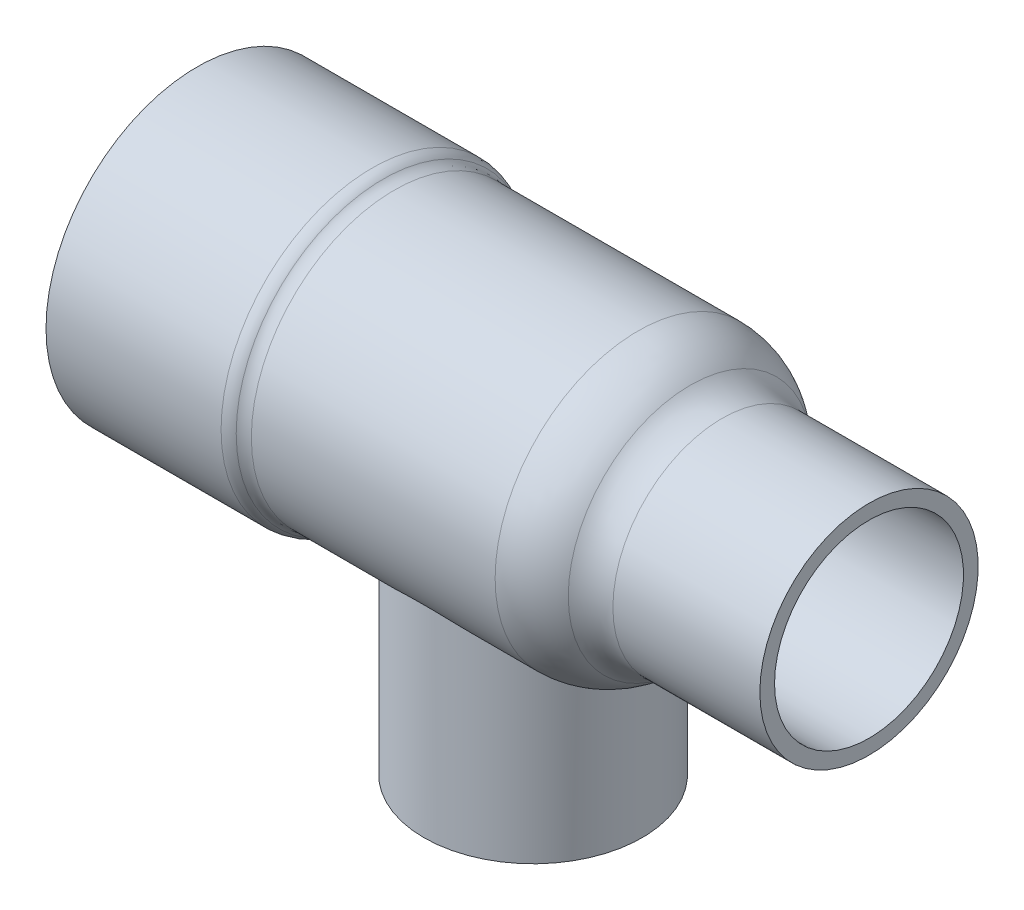
ISO-10303-21;
HEADER;
FILE_DESCRIPTION(('STEP AP214'),'2;1');
FILE_NAME('part.step','',(''),(''),'','','');
FILE_SCHEMA(('AUTOMOTIVE_DESIGN { 1 0 10303 214 1 1 1 1 }'));
ENDSEC;
DATA;
#1=APPLICATION_CONTEXT('core data for automotive mechanical design processes');
#2=APPLICATION_PROTOCOL_DEFINITION('international standard','automotive_design',2000,#1);
#3=PRODUCT_CONTEXT('',#1,'mechanical');
#4=PRODUCT('Part','Part','',(#3));
#5=PRODUCT_RELATED_PRODUCT_CATEGORY('part','',(#4));
#6=PRODUCT_DEFINITION_FORMATION('','',#4);
#7=PRODUCT_DEFINITION_CONTEXT('part definition',#1,'design');
#8=PRODUCT_DEFINITION('design','',#6,#7);
#9=PRODUCT_DEFINITION_SHAPE('','',#8);
#10=(LENGTH_UNIT() NAMED_UNIT(*) SI_UNIT(.MILLI.,.METRE.));
#11=(NAMED_UNIT(*) PLANE_ANGLE_UNIT() SI_UNIT($,.RADIAN.));
#12=(NAMED_UNIT(*) SI_UNIT($,.STERADIAN.) SOLID_ANGLE_UNIT());
#13=UNCERTAINTY_MEASURE_WITH_UNIT(LENGTH_MEASURE(1.E-05),#10,'distance_accuracy_value','');
#14=(GEOMETRIC_REPRESENTATION_CONTEXT(3) GLOBAL_UNCERTAINTY_ASSIGNED_CONTEXT((#13)) GLOBAL_UNIT_ASSIGNED_CONTEXT((#10,
#11,#12)) REPRESENTATION_CONTEXT('',''));
#15=CARTESIAN_POINT('',(0.,0.,0.));
#16=DIRECTION('',(0.,0.,1.));
#17=DIRECTION('',(1.,0.,0.));
#18=AXIS2_PLACEMENT_3D('',#15,#16,#17);
#19=CARTESIAN_POINT('',(66.675,0.,0.));
#20=DIRECTION('',(-1.,0.,0.));
#21=DIRECTION('',(0.,0.,1.));
#22=AXIS2_PLACEMENT_3D('',#19,#20,#21);
#23=DEGENERATE_TOROIDAL_SURFACE('',#22,10.2185400497512,11.3968599502488,.T.);
#24=CARTESIAN_POINT('',(74.5632953226745,0.,0.));
#25=DIRECTION('',(-1.,0.,0.));
#26=DIRECTION('',(0.,0.,1.));
#27=AXIS2_PLACEMENT_3D('',#24,#25,#26);
#28=CIRCLE('',#27,18.4443052802848);
#29=CARTESIAN_POINT('',(74.5632953226745,0.,18.4443052802848));
#30=VERTEX_POINT('',#29);
#31=EDGE_CURVE('E70',#30,#30,#28,.T.);
#32=ORIENTED_EDGE('',*,*,#31,.T.);
#33=EDGE_LOOP('',(#32));
#34=FACE_BOUND('',#33,.T.);
#35=CARTESIAN_POINT('',(66.675,0.,0.));
#36=DIRECTION('',(-1.,0.,0.));
#37=DIRECTION('',(0.,0.,1.));
#38=AXIS2_PLACEMENT_3D('',#35,#36,#37);
#39=CIRCLE('',#38,21.6154);
#40=CARTESIAN_POINT('',(66.675,-21.1343569138027,4.53480705212464));
#41=VERTEX_POINT('',#40);
#42=CARTESIAN_POINT('',(66.675,-21.1343569138027,-4.53480705212464));
#43=VERTEX_POINT('',#42);
#44=EDGE_CURVE('E64',#41,#43,#39,.T.);
#45=ORIENTED_EDGE('',*,*,#44,.F.);
#46=CARTESIAN_POINT('',(66.6748,-21.1342066831035,-4.53550713371719));
#47=CARTESIAN_POINT('',(66.7265053733702,-21.1730429598855,-4.35453874536674));
#48=CARTESIAN_POINT('',(66.7752468642663,-21.2093816243595,-4.17221330940152));
#49=CARTESIAN_POINT('',(66.8666374734281,-21.2771154417119,-3.8051326207815));
#50=CARTESIAN_POINT('',(66.9092865645401,-21.3085105725571,-3.62037735730102));
#51=CARTESIAN_POINT('',(67.02782157486,-21.3953386331752,-3.06301839572986));
#52=CARTESIAN_POINT('',(67.0943295905594,-21.4434398070754,-2.68720164863826));
#53=CARTESIAN_POINT('',(67.1997640755975,-21.5192721348413,-1.94062188010525));
#54=CARTESIAN_POINT('',(67.2394126973455,-21.5475374282524,-1.57001334595412));
#55=CARTESIAN_POINT('',(67.2935402521722,-21.5860473852722,-0.826027143166469));
#56=CARTESIAN_POINT('',(67.3080196006113,-21.5962923462649,-0.45264952032944));
#57=CARTESIAN_POINT('',(67.3116620673646,-21.5988742233138,0.307098036673452));
#58=CARTESIAN_POINT('',(67.2999407666999,-21.590585521205,0.693474793336534));
#59=CARTESIAN_POINT('',(67.2495286096489,-21.5547456602094,1.46357593006966));
#60=CARTESIAN_POINT('',(67.2108356804257,-21.5271930208406,1.84730010399291));
#61=CARTESIAN_POINT('',(67.1054828778905,-21.4514970037585,2.62070022469284));
#62=CARTESIAN_POINT('',(67.0380216764161,-21.4027628106309,3.01021126935844));
#63=CARTESIAN_POINT('',(66.916673192167,-21.3139413402748,3.58771721824447));
#64=CARTESIAN_POINT('',(66.8728560127411,-21.2817080252614,3.77912116642253));
#65=CARTESIAN_POINT('',(66.7786850110917,-21.2119443717478,4.15933699606426));
#66=CARTESIAN_POINT('',(66.7283312273101,-21.1744140643992,4.34814889276463));
#67=CARTESIAN_POINT('',(66.6748,-21.1342066831035,4.53550713371719));
#68=B_SPLINE_CURVE_WITH_KNOTS('',3,(#46,#47,#48,#49,#50,#51,#52,#53,#54,#55,#56,#57,#58,#59,#60,
#61,#62,#63,#64,#65,#66,#67),.UNSPECIFIED.,.F.,.F.,(4,2,2,2,2,2,2,2,2,2,4),(0.,
0.576432800066325,1.15286816920234,2.30535826513562,3.42548144891161,4.54558614748008,
5.7040694578055,6.8626418102821,8.05584230677583,8.65262499275403,9.24940416919813),.UNSPECIFIED.);
#69=EDGE_CURVE('E53',#43,#41,#68,.T.);
#70=ORIENTED_EDGE('',*,*,#69,.F.);
#71=EDGE_LOOP('',(#45,#70));
#72=FACE_BOUND('',#71,.T.);
#73=ADVANCED_FACE('F38',(#34,#72),#23,.T.);
#74=CARTESIAN_POINT('',(0.,0.,0.));
#75=DIRECTION('',(-1.,0.,0.));
#76=DIRECTION('',(0.,0.,1.));
#77=AXIS2_PLACEMENT_3D('',#74,#75,#76);
#78=CYLINDRICAL_SURFACE('',#77,21.6154);
#79=CARTESIAN_POINT('',(29.8073429783396,0.,0.));
#80=DIRECTION('',(-1.,0.,0.));
#81=DIRECTION('',(0.,0.,1.));
#82=AXIS2_PLACEMENT_3D('',#79,#80,#81);
#83=CIRCLE('',#82,21.6154);
#84=CARTESIAN_POINT('',(29.8073429783396,0.,21.6154));
#85=VERTEX_POINT('',#84);
#86=EDGE_CURVE('E183',#85,#85,#83,.F.);
#87=ORIENTED_EDGE('',*,*,#86,.T.);
#88=EDGE_LOOP('',(#87));
#89=FACE_BOUND('',#88,.T.);
#90=ORIENTED_EDGE('',*,*,#44,.T.);
#91=CARTESIAN_POINT('',(66.675,-21.1343569138027,4.53480705212464));
#92=CARTESIAN_POINT('',(66.6114547680632,-21.0866271290208,4.75726492396867));
#93=CARTESIAN_POINT('',(66.5434275275538,-21.0356513856825,4.97769541490188));
#94=CARTESIAN_POINT('',(66.3987225833328,-20.9275711099614,5.41412956573645));
#95=CARTESIAN_POINT('',(66.3220463514995,-20.8704676204736,5.63013397149424));
#96=CARTESIAN_POINT('',(66.0797266408967,-20.690667278245,6.2704098081925));
#97=CARTESIAN_POINT('',(65.9015961374546,-20.5593325486805,6.68762547240822));
#98=CARTESIAN_POINT('',(65.5165160167353,-20.2781683495389,7.49689428643744));
#99=CARTESIAN_POINT('',(65.3098349992959,-20.1285125837919,7.88913722410543));
#100=CARTESIAN_POINT('',(64.8688629783147,-19.8129902262155,8.65106899972249));
#101=CARTESIAN_POINT('',(64.6345629594758,-19.6471183442103,9.0207504131232));
#102=CARTESIAN_POINT('',(64.141959868238,-19.3034280045157,9.73443585542271));
#103=CARTESIAN_POINT('',(63.8837922184664,-19.1256783639775,10.0785669228957));
#104=CARTESIAN_POINT('',(63.3442549518248,-18.7607106221728,10.7426625853691));
#105=CARTESIAN_POINT('',(63.0628873522892,-18.5734933447039,11.0626292769393));
#106=CARTESIAN_POINT('',(62.4771655187865,-18.1920856530713,11.6792763537308));
#107=CARTESIAN_POINT('',(62.1727214021267,-17.9978696996235,11.9758554260638));
#108=CARTESIAN_POINT('',(61.5429090350775,-17.6066634145188,12.5439180307483));
#109=CARTESIAN_POINT('',(61.2175390602014,-17.4096728552559,12.8153994903165));
#110=CARTESIAN_POINT('',(60.4921848585702,-16.9848134269864,13.3747536021058));
#111=CARTESIAN_POINT('',(60.0886484885038,-16.7571081925235,13.6581653410847));
#112=CARTESIAN_POINT('',(59.2545685333148,-16.309542968237,14.189611048107));
#113=CARTESIAN_POINT('',(58.8240155958743,-16.0896857369362,14.4376326668007));
#114=CARTESIAN_POINT('',(57.9371732136069,-15.666310759041,14.8959446222587));
#115=CARTESIAN_POINT('',(57.4809599173637,-15.4627486043192,15.1063395793857));
#116=CARTESIAN_POINT('',(56.7771506500392,-15.176493967785,15.3921344117578));
#117=CARTESIAN_POINT('',(56.539370828527,-15.0842810681633,15.4824113125948));
#118=CARTESIAN_POINT('',(56.0572776156536,-14.9075169045681,15.652683403793));
#119=CARTESIAN_POINT('',(55.8129629271783,-14.8229671765041,15.7326765343432));
#120=CARTESIAN_POINT('',(55.2673611399745,-14.6466090176594,15.8971615167179));
#121=CARTESIAN_POINT('',(54.964659983212,-14.5568644614955,15.9792152308502));
#122=CARTESIAN_POINT('',(54.3510774259041,-14.3933388604959,16.1266689068221));
#123=CARTESIAN_POINT('',(54.0401989984028,-14.3195521013918,16.1920748314958));
#124=CARTESIAN_POINT('',(53.411999378714,-14.1906196615389,16.3051892782452));
#125=CARTESIAN_POINT('',(53.0946911967409,-14.1354396817394,16.3529303789957));
#126=CARTESIAN_POINT('',(52.4549130372377,-14.0457782174649,16.4300076588886));
#127=CARTESIAN_POINT('',(52.1324430759553,-14.0112966678505,16.4593438959524));
#128=CARTESIAN_POINT('',(51.4826619730465,-13.9644484226618,16.4991110974726));
#129=CARTESIAN_POINT('',(51.1553331277139,-13.9522225093127,16.5094217173638));
#130=CARTESIAN_POINT('',(50.5006058738565,-13.9509098947576,16.5105308996224));
#131=CARTESIAN_POINT('',(50.173207467522,-13.9618225493815,16.5013300051838));
#132=CARTESIAN_POINT('',(49.5207648902208,-14.0062773120849,16.4636128697922));
#133=CARTESIAN_POINT('',(49.1957233815938,-14.0398418936424,16.4350774465131));
#134=CARTESIAN_POINT('',(48.5507393786836,-14.1280727950525,16.3592917463558));
#135=CARTESIAN_POINT('',(48.2307976006905,-14.1827420524666,16.3120388641689));
#136=CARTESIAN_POINT('',(47.5357798282096,-14.3235167799073,16.1886619710859));
#137=CARTESIAN_POINT('',(47.1622110287963,-14.4136867831088,16.1086911652795));
#138=CARTESIAN_POINT('',(46.4272716592375,-14.6164709183712,15.9249163813675));
#139=CARTESIAN_POINT('',(46.0659040055114,-14.7290903726918,15.8211067507239));
#140=CARTESIAN_POINT('',(45.3557828406338,-14.9724201373142,15.5910301085803));
#141=CARTESIAN_POINT('',(45.0070584728236,-15.1031692600929,15.4647147463302));
#142=CARTESIAN_POINT('',(44.3235434501339,-15.3782972043456,15.1911537103326));
#143=CARTESIAN_POINT('',(43.9887537526877,-15.5226769601428,15.0439066014506));
#144=CARTESIAN_POINT('',(43.2061044923637,-15.8791837760808,14.6685856039813));
#145=CARTESIAN_POINT('',(42.7647205672124,-16.095877529195,14.4313058350355));
#146=CARTESIAN_POINT('',(41.9089841740275,-16.5397033595535,13.9204300711292));
#147=CARTESIAN_POINT('',(41.4946413116934,-16.7668390977572,13.6468212747456));
#148=CARTESIAN_POINT('',(40.6929987571128,-17.224650819057,13.0642378959392));
#149=CARTESIAN_POINT('',(40.3057244429271,-17.4553298835022,12.7552308234827));
#150=CARTESIAN_POINT('',(39.5595809479589,-17.9138462221372,12.1028352770736));
#151=CARTESIAN_POINT('',(39.2007080530641,-18.1416838646121,11.7594513120048));
#152=CARTESIAN_POINT('',(38.5085295644043,-18.5918183639959,11.034230074157));
#153=CARTESIAN_POINT('',(38.1756065401927,-18.8140081108021,10.6519598440116));
#154=CARTESIAN_POINT('',(37.5429072260697,-19.244276116504,9.85338263890061));
#155=CARTESIAN_POINT('',(37.2431352074564,-19.4523525556567,9.43707128994281));
#156=CARTESIAN_POINT('',(36.6806310825456,-19.8484817958852,8.57255086431778));
#157=CARTESIAN_POINT('',(36.4178132388845,-20.0365806899858,8.12441937811357));
#158=CARTESIAN_POINT('',(36.0538355509152,-20.2999462408844,7.42961105027716));
#159=CARTESIAN_POINT('',(35.9375636954963,-20.3845949718886,7.19427030345323));
#160=CARTESIAN_POINT('',(35.7155332474467,-20.5470391433618,6.71627955231131));
#161=CARTESIAN_POINT('',(35.6097771907034,-20.6248329302471,6.47362780323713));
#162=CARTESIAN_POINT('',(35.3677821107589,-20.8035963164568,5.87945429215759));
#163=CARTESIAN_POINT('',(35.2370862887128,-20.900800439867,5.52450955064964));
#164=CARTESIAN_POINT('',(34.9994289590413,-21.078359204465,4.8027468228773));
#165=CARTESIAN_POINT('',(34.8924617491128,-21.1587178935803,4.43593171355386));
#166=CARTESIAN_POINT('',(34.703665837327,-21.3010220741024,3.69257064826921));
#167=CARTESIAN_POINT('',(34.6218237903488,-21.3629773398386,3.31602997362708));
#168=CARTESIAN_POINT('',(34.484394589662,-21.4672399443122,2.55547375473092));
#169=CARTESIAN_POINT('',(34.4288082752731,-21.5095466549415,2.17145797192784));
#170=CARTESIAN_POINT('',(34.344620977642,-21.5736915662985,1.39738704758098));
#171=CARTESIAN_POINT('',(34.3161159465816,-21.5954569850148,1.00731537212416));
#172=CARTESIAN_POINT('',(34.286906770921,-21.6177606505843,0.225522905346227));
#173=CARTESIAN_POINT('',(34.2862025404393,-21.6182989630117,-0.166197880876772));
#174=CARTESIAN_POINT('',(34.3126069871452,-21.5981358881238,-0.948175221780285));
#175=CARTESIAN_POINT('',(34.3397177526135,-21.5774329060649,-1.33843166431358));
#176=CARTESIAN_POINT('',(34.4213043884607,-21.5152594611924,-2.11438359009839));
#177=CARTESIAN_POINT('',(34.4757796832373,-21.4737894352054,-2.50007916911123));
#178=CARTESIAN_POINT('',(34.607701324754,-21.3736803837495,-3.24420453938393));
#179=CARTESIAN_POINT('',(34.6838066570313,-21.3160456950038,-3.60300958105077));
#180=CARTESIAN_POINT('',(34.8588133553579,-21.1840399556166,-4.31183649008724));
#181=CARTESIAN_POINT('',(34.9577137456006,-21.1096696213947,-4.66185873271829));
#182=CARTESIAN_POINT('',(35.1771306334655,-20.9455046961939,-5.35135162992789));
#183=CARTESIAN_POINT('',(35.2976487576815,-20.8557089445743,-5.69082148825147));
#184=CARTESIAN_POINT('',(35.5590244914479,-20.6621644156034,-6.35775769344199));
#185=CARTESIAN_POINT('',(35.6998848165031,-20.5584137755243,-6.68522243040154));
#186=CARTESIAN_POINT('',(36.0144514802185,-20.3284358633425,-7.35644998027903));
#187=CARTESIAN_POINT('',(36.1899862659138,-20.201019446893,-7.69894778277624));
#188=CARTESIAN_POINT('',(36.5621085647524,-19.933545472869,-8.36712726200814));
#189=CARTESIAN_POINT('',(36.7586971406113,-19.7934872772414,-8.69280808865457));
#190=CARTESIAN_POINT('',(37.1715205300071,-19.502804186495,-9.32672425485717));
#191=CARTESIAN_POINT('',(37.3877639609926,-19.3521746631568,-9.63495184518172));
#192=CARTESIAN_POINT('',(37.8385275405137,-19.0425407102287,-10.2333117941628));
#193=CARTESIAN_POINT('',(38.0730496616667,-18.883535377332,-10.5234421936897));
#194=CARTESIAN_POINT('',(38.6068494664389,-18.5275835576479,-11.1402200447746));
#195=CARTESIAN_POINT('',(38.9098196334306,-18.3293001567937,-11.4629070670894));
#196=CARTESIAN_POINT('',(39.5388947576876,-17.9276122045451,-12.0814845086904));
#197=CARTESIAN_POINT('',(39.8650035331209,-17.7242068115452,-12.3773704870349));
#198=CARTESIAN_POINT('',(40.5396784668636,-17.31610103006,-12.9421653514818));
#199=CARTESIAN_POINT('',(40.8882657160866,-17.1113995927935,-13.211048278352));
#200=CARTESIAN_POINT('',(41.6070514568823,-16.7053207477409,-13.7209307444376));
#201=CARTESIAN_POINT('',(41.9772469761036,-16.5039428876417,-13.9619341051239));
#202=CARTESIAN_POINT('',(42.6930676444965,-16.1333724872349,-14.3878282030173));
#203=CARTESIAN_POINT('',(43.0362611283948,-15.9632299949406,-14.5759805465865));
#204=CARTESIAN_POINT('',(43.7392638542564,-15.6333952711293,-14.9291942616271));
#205=CARTESIAN_POINT('',(44.0990740573482,-15.473703645396,-15.0942542951845));
#206=CARTESIAN_POINT('',(44.8345154968098,-15.1697234125155,-15.3997196487843));
#207=CARTESIAN_POINT('',(45.2101179233858,-15.0254083208337,-15.5401676387743));
#208=CARTESIAN_POINT('',(45.9771415802431,-14.7572516201232,-15.7950399631647));
#209=CARTESIAN_POINT('',(46.3685570989161,-14.6334026996562,-15.9094735965775));
#210=CARTESIAN_POINT('',(47.0656505662059,-14.439825281057,-16.0850709238814));
#211=CARTESIAN_POINT('',(47.3681772048412,-14.364316026871,-16.1523954905357));
#212=CARTESIAN_POINT('',(47.980179161978,-14.230521212704,-16.2703951345413));
#213=CARTESIAN_POINT('',(48.2896524756691,-14.1722307504317,-16.3210749512111));
#214=CARTESIAN_POINT('',(48.9135618631003,-14.0751300550216,-16.4048883822826));
#215=CARTESIAN_POINT('',(49.2279901898587,-14.036292026921,-16.4380470358651));
#216=CARTESIAN_POINT('',(49.8601386286396,-13.97961712379,-16.4862738101036));
#217=CARTESIAN_POINT('',(50.1778587216868,-13.9617801277681,-16.5013420349823));
#218=CARTESIAN_POINT('',(50.8151453813017,-13.9478976148185,-16.5130784049684));
#219=CARTESIAN_POINT('',(51.1347146000395,-13.9519223658826,-16.5096872177894));
#220=CARTESIAN_POINT('',(51.7720839074897,-13.98173817266,-16.4844437400155));
#221=CARTESIAN_POINT('',(52.0898840056446,-14.0075291120848,-16.4625915480508));
#222=CARTESIAN_POINT('',(52.7217247465447,-14.079765153913,-16.4008527237899));
#223=CARTESIAN_POINT('',(53.0357602975793,-14.1262355619665,-16.3609439945443));
#224=CARTESIAN_POINT('',(53.6577494121564,-14.2379233325025,-16.2638404316158));
#225=CARTESIAN_POINT('',(53.9657020753079,-14.3031434484265,-16.206643058989));
#226=CARTESIAN_POINT('',(54.6638299503346,-14.4716445309092,-16.0565632635351));
#227=CARTESIAN_POINT('',(55.0514761309457,-14.5804777291373,-15.9581316440116));
#228=CARTESIAN_POINT('',(55.8123322072655,-14.820199362343,-15.7357519168669));
#229=CARTESIAN_POINT('',(56.1855373018504,-14.9510950561182,-15.6117954082981));
#230=CARTESIAN_POINT('',(56.9174781615079,-15.2300419773322,-15.3397964104087));
#231=CARTESIAN_POINT('',(57.276177846312,-15.378132814041,-15.1916979799418));
#232=CARTESIAN_POINT('',(57.9778891026931,-15.6865611794069,-14.8730131571323));
#233=CARTESIAN_POINT('',(58.3209003477589,-15.846898962765,-14.7024262970418));
#234=CARTESIAN_POINT('',(59.1047127230197,-16.2314710794194,-14.2783784087721));
#235=CARTESIAN_POINT('',(59.5393280105868,-16.4589676062247,-14.0164069947018));
#236=CARTESIAN_POINT('',(60.3804144141094,-16.9205864843608,-13.4555320985591));
#237=CARTESIAN_POINT('',(60.7868757964839,-17.1547110881805,-13.1566159421385));
#238=CARTESIAN_POINT('',(61.5708909311521,-17.6226744971426,-12.5228606975138));
#239=CARTESIAN_POINT('',(61.9484465579063,-17.8565133198478,-12.1880239420509));
#240=CARTESIAN_POINT('',(62.6732227149587,-18.3177720872967,-11.4831218679308));
#241=CARTESIAN_POINT('',(63.0204526472816,-18.5451940065961,-11.1130675428368));
#242=CARTESIAN_POINT('',(63.6260164053209,-18.9502121574653,-10.404421789188));
#243=CARTESIAN_POINT('',(63.8894129088549,-19.1296924121919,-10.0712236607308));
#244=CARTESIAN_POINT('',(64.3922736376311,-19.4772249162637,-9.38148831037277));
#245=CARTESIAN_POINT('',(64.6317361961733,-19.6452763694758,-9.02494946594019));
#246=CARTESIAN_POINT('',(65.0839893844724,-19.9662837268743,-8.29054581458276));
#247=CARTESIAN_POINT('',(65.2968585278447,-20.1192837697471,-7.9127488019752));
#248=CARTESIAN_POINT('',(65.6943926113476,-20.4075877127064,-7.13632946300653));
#249=CARTESIAN_POINT('',(65.8790736356188,-20.5429016980765,-6.7377191882875));
#250=CARTESIAN_POINT('',(66.1688919932864,-20.7567253056857,-6.03953024477416));
#251=CARTESIAN_POINT('',(66.2815907755315,-20.8403483075586,-5.74463310784466));
#252=CARTESIAN_POINT('',(66.4907249925941,-20.9961780666595,-5.14605694287832));
#253=CARTESIAN_POINT('',(66.5871541371359,-21.0683804076842,-4.84237457115073));
#254=CARTESIAN_POINT('',(66.675,-21.1343569138027,-4.53480705212464));
#255=B_SPLINE_CURVE_WITH_KNOTS('',3,(#91,#92,#93,#94,#95,#96,#97,#98,#99,#100,#101,#102,#103,
#104,#105,#106,#107,#108,#109,#110,#111,#112,#113,#114,#115,#116,#117,#118,#119,#120,#121,#122,
#123,#124,#125,#126,#127,#128,#129,#130,#131,#132,#133,#134,#135,#136,#137,#138,#139,#140,#141,
#142,#143,#144,#145,#146,#147,#148,#149,#150,#151,#152,#153,#154,#155,#156,#157,#158,#159,#160,
#161,#162,#163,#164,#165,#166,#167,#168,#169,#170,#171,#172,#173,#174,#175,#176,#177,#178,#179,
#180,#181,#182,#183,#184,#185,#186,#187,#188,#189,#190,#191,#192,#193,#194,#195,#196,#197,#198,
#199,#200,#201,#202,#203,#204,#205,#206,#207,#208,#209,#210,#211,#212,#213,#214,#215,#216,#217,
#218,#219,#220,#221,#222,#223,#224,#225,#226,#227,#228,#229,#230,#231,#232,#233,#234,#235,#236,
#237,#238,#239,#240,#241,#242,#243,#244,#245,#246,#247,#248,#249,#250,#251,#252,#253,#254),
.UNSPECIFIED.,.F.,.F.,(4,2,2,2,2,2,2,2,2,2,2,2,2,2,2,2,2,2,2,2,2,2,2,2,2,2,2,2,2,2,2,2,2,2,2,2,
2,2,2,2,2,2,2,2,2,2,2,2,2,2,2,2,2,2,2,2,2,2,2,2,2,2,2,2,2,2,2,2,2,2,2,2,2,2,2,2,2,2,2,2,2,4),
(0.,0.708523428218881,1.41692646189978,2.83156804374201,4.23370778917312,5.63630649012626,
7.03138541513295,8.42634315975301,9.82704501252821,11.2278624445233,12.8554463843035,
14.4835968863076,16.1071474661328,16.9184542393434,17.7299232627354,18.7077051274516,
19.6851362800333,20.6607556946101,21.636372038834,22.6181386630519,23.5998779555785,
24.5825926880466,25.5654442540069,26.7412505620037,27.9173359594695,29.0959791840166,
30.274703258391,31.9103394324002,33.5465535000997,35.1842815721771,36.8217951200581,
38.4801042505236,40.1386267953501,41.7932355630607,42.620335105801,43.4476336225219,
44.6179690908919,45.7880230065654,46.9574543736506,48.126923121543,49.3005201499692,
50.4741135529543,51.6477950728633,52.8214519058717,53.9341106121376,55.0467216967587,
56.1594165332678,57.2722600422828,58.48730193105,59.702405179466,60.9180437699006,
62.1338137329236,63.5874350602143,65.0412968140746,66.4965431129714,67.9515897033281,
69.2309197017458,70.5103237908617,71.7874873448639,73.0641936475085,74.0203098772454,
74.9761536321248,75.9306276879768,76.8850962448716,77.8426344647163,78.8001675688315,
79.7588756507534,80.7177245933351,81.959290302234,83.2012652998002,84.4461601878881,
85.6910809732358,87.3572658841568,89.0240239952214,90.6906739298006,92.3568052966561,
93.7388585881924,95.1210080555032,96.4989753007262,97.8761533145526,98.8552290158893,
99.834682390854),.UNSPECIFIED.);
#256=EDGE_CURVE('E55',#41,#43,#255,.T.);
#257=ORIENTED_EDGE('',*,*,#256,.F.);
#258=EDGE_LOOP('',(#90,#257));
#259=FACE_BOUND('',#258,.T.);
#260=ADVANCED_FACE('F68',(#89,#259),#78,.T.);
#261=CARTESIAN_POINT('',(0.,0.,0.));
#262=DIRECTION('',(-1.,0.,0.));
#263=DIRECTION('',(0.,0.,1.));
#264=AXIS2_PLACEMENT_3D('',#261,#262,#263);
#265=CYLINDRICAL_SURFACE('',#264,14.2875);
#266=CARTESIAN_POINT('',(101.6,0.,0.));
#267=DIRECTION('',(-1.,0.,0.));
#268=DIRECTION('',(0.,0.,1.));
#269=AXIS2_PLACEMENT_3D('',#266,#267,#268);
#270=CIRCLE('',#269,14.2875);
#271=CARTESIAN_POINT('',(101.6,0.,14.2875));
#272=VERTEX_POINT('',#271);
#273=EDGE_CURVE('E90',#272,#272,#270,.T.);
#274=ORIENTED_EDGE('',*,*,#273,.F.);
#275=EDGE_LOOP('',(#274));
#276=FACE_BOUND('',#275,.T.);
#277=CARTESIAN_POINT('',(79.375,0.,0.));
#278=DIRECTION('',(-1.,0.,0.));
#279=DIRECTION('',(0.,0.,1.));
#280=AXIS2_PLACEMENT_3D('',#277,#278,#279);
#281=CIRCLE('',#280,14.2875);
#282=CARTESIAN_POINT('',(79.375,0.,14.2875));
#283=VERTEX_POINT('',#282);
#284=EDGE_CURVE('E104',#283,#283,#281,.T.);
#285=ORIENTED_EDGE('',*,*,#284,.T.);
#286=EDGE_LOOP('',(#285));
#287=FACE_BOUND('',#286,.T.);
#288=ADVANCED_FACE('F139',(#276,#287),#265,.F.);
#289=CARTESIAN_POINT('',(101.6,16.51,0.));
#290=DIRECTION('',(1.,0.,0.));
#291=DIRECTION('',(0.,0.,-1.));
#292=AXIS2_PLACEMENT_3D('',#289,#290,#291);
#293=PLANE('',#292);
#294=ORIENTED_EDGE('',*,*,#273,.T.);
#295=EDGE_LOOP('',(#294));
#296=FACE_BOUND('',#295,.T.);
#297=CARTESIAN_POINT('',(101.6,0.,0.));
#298=DIRECTION('',(-1.,0.,0.));
#299=DIRECTION('',(0.,0.,1.));
#300=AXIS2_PLACEMENT_3D('',#297,#298,#299);
#301=CIRCLE('',#300,16.51);
#302=CARTESIAN_POINT('',(101.6,0.,16.51));
#303=VERTEX_POINT('',#302);
#304=EDGE_CURVE('E86',#303,#303,#301,.T.);
#305=ORIENTED_EDGE('',*,*,#304,.F.);
#306=EDGE_LOOP('',(#305));
#307=FACE_BOUND('',#306,.T.);
#308=ADVANCED_FACE('F152',(#296,#307),#293,.T.);
#309=CARTESIAN_POINT('',(0.,0.,0.));
#310=DIRECTION('',(-1.,0.,0.));
#311=DIRECTION('',(0.,0.,1.));
#312=AXIS2_PLACEMENT_3D('',#309,#310,#311);
#313=CYLINDRICAL_SURFACE('',#312,16.51);
#314=ORIENTED_EDGE('',*,*,#304,.T.);
#315=EDGE_LOOP('',(#314));
#316=FACE_BOUND('',#315,.T.);
#317=CARTESIAN_POINT('',(79.375,0.,0.));
#318=DIRECTION('',(-1.,0.,0.));
#319=DIRECTION('',(0.,0.,1.));
#320=AXIS2_PLACEMENT_3D('',#317,#318,#319);
#321=CIRCLE('',#320,16.51);
#322=CARTESIAN_POINT('',(79.375,0.,16.51));
#323=VERTEX_POINT('',#322);
#324=EDGE_CURVE('E76',#323,#323,#321,.T.);
#325=ORIENTED_EDGE('',*,*,#324,.F.);
#326=EDGE_LOOP('',(#325));
#327=FACE_BOUND('',#326,.T.);
#328=ADVANCED_FACE('F148',(#316,#327),#313,.T.);
#329=CARTESIAN_POINT('',(79.375,0.,0.));
#330=DIRECTION('',(-1.,0.,0.));
#331=DIRECTION('',(0.,0.,1.));
#332=AXIS2_PLACEMENT_3D('',#329,#330,#331);
#333=TOROIDAL_SURFACE('',#332,23.4618599502488,6.95185995024876);
#334=ORIENTED_EDGE('',*,*,#324,.T.);
#335=EDGE_LOOP('',(#334));
#336=FACE_BOUND('',#335,.T.);
#337=ORIENTED_EDGE('',*,*,#31,.F.);
#338=EDGE_LOOP('',(#337));
#339=FACE_BOUND('',#338,.T.);
#340=ADVANCED_FACE('F144',(#336,#339),#333,.F.);
#341=CARTESIAN_POINT('',(0.,0.,0.));
#342=DIRECTION('',(-1.,0.,0.));
#343=DIRECTION('',(0.,0.,1.));
#344=AXIS2_PLACEMENT_3D('',#341,#342,#343);
#345=CYLINDRICAL_SURFACE('',#344,22.86);
#346=CARTESIAN_POINT('',(26.4762610459939,0.,0.));
#347=DIRECTION('',(1.,0.,0.));
#348=DIRECTION('',(0.,0.,-1.));
#349=AXIS2_PLACEMENT_3D('',#346,#347,#348);
#350=CIRCLE('',#349,22.86);
#351=CARTESIAN_POINT('',(26.4762610459939,0.,-22.86));
#352=VERTEX_POINT('',#351);
#353=EDGE_CURVE('E180',#352,#352,#350,.F.);
#354=ORIENTED_EDGE('',*,*,#353,.T.);
#355=EDGE_LOOP('',(#354));
#356=FACE_BOUND('',#355,.T.);
#357=CARTESIAN_POINT('',(0.,0.,0.));
#358=DIRECTION('',(-1.,0.,0.));
#359=DIRECTION('',(0.,0.,1.));
#360=AXIS2_PLACEMENT_3D('',#357,#358,#359);
#361=CIRCLE('',#360,22.86);
#362=CARTESIAN_POINT('',(0.,0.,22.86));
#363=VERTEX_POINT('',#362);
#364=EDGE_CURVE('E71',#363,#363,#361,.T.);
#365=ORIENTED_EDGE('',*,*,#364,.F.);
#366=EDGE_LOOP('',(#365));
#367=FACE_BOUND('',#366,.T.);
#368=ADVANCED_FACE('F147',(#356,#367),#345,.T.);
#369=CARTESIAN_POINT('',(0.,20.6375,0.));
#370=DIRECTION('',(-1.,0.,0.));
#371=DIRECTION('',(0.,0.,1.));
#372=AXIS2_PLACEMENT_3D('',#369,#370,#371);
#373=PLANE('',#372);
#374=ORIENTED_EDGE('',*,*,#364,.T.);
#375=EDGE_LOOP('',(#374));
#376=FACE_BOUND('',#375,.T.);
#377=CARTESIAN_POINT('',(0.,0.,0.));
#378=DIRECTION('',(-1.,0.,0.));
#379=DIRECTION('',(0.,0.,1.));
#380=AXIS2_PLACEMENT_3D('',#377,#378,#379);
#381=CIRCLE('',#380,20.6375);
#382=CARTESIAN_POINT('',(0.,0.,20.6375));
#383=VERTEX_POINT('',#382);
#384=EDGE_CURVE('E79',#383,#383,#381,.T.);
#385=ORIENTED_EDGE('',*,*,#384,.F.);
#386=EDGE_LOOP('',(#385));
#387=FACE_BOUND('',#386,.T.);
#388=ADVANCED_FACE('F297',(#376,#387),#373,.T.);
#389=CARTESIAN_POINT('',(0.,0.,0.));
#390=DIRECTION('',(-1.,0.,0.));
#391=DIRECTION('',(0.,0.,1.));
#392=AXIS2_PLACEMENT_3D('',#389,#390,#391);
#393=CYLINDRICAL_SURFACE('',#392,20.6375);
#394=CARTESIAN_POINT('',(23.2151570216604,0.,0.));
#395=DIRECTION('',(1.,0.,0.));
#396=DIRECTION('',(0.,0.,-1.));
#397=AXIS2_PLACEMENT_3D('',#394,#395,#396);
#398=CIRCLE('',#397,20.6375);
#399=CARTESIAN_POINT('',(23.2151570216604,0.,-20.6375));
#400=VERTEX_POINT('',#399);
#401=EDGE_CURVE('E94',#400,#400,#398,.T.);
#402=ORIENTED_EDGE('',*,*,#401,.T.);
#403=EDGE_LOOP('',(#402));
#404=FACE_BOUND('',#403,.T.);
#405=ORIENTED_EDGE('',*,*,#384,.T.);
#406=EDGE_LOOP('',(#405));
#407=FACE_BOUND('',#406,.T.);
#408=ADVANCED_FACE('F129',(#404,#407),#393,.F.);
#409=CARTESIAN_POINT('',(0.,0.,0.));
#410=DIRECTION('',(-1.,0.,0.));
#411=DIRECTION('',(0.,0.,1.));
#412=AXIS2_PLACEMENT_3D('',#409,#410,#411);
#413=CYLINDRICAL_SURFACE('',#412,19.3929);
#414=CARTESIAN_POINT('',(26.5462389540061,0.,0.));
#415=DIRECTION('',(1.,0.,0.));
#416=DIRECTION('',(0.,0.,-1.));
#417=AXIS2_PLACEMENT_3D('',#414,#415,#416);
#418=CIRCLE('',#417,19.3929);
#419=CARTESIAN_POINT('',(26.5462389540061,0.,-19.3929));
#420=VERTEX_POINT('',#419);
#421=EDGE_CURVE('E47',#420,#420,#418,.F.);
#422=ORIENTED_EDGE('',*,*,#421,.T.);
#423=EDGE_LOOP('',(#422));
#424=FACE_BOUND('',#423,.T.);
#425=CARTESIAN_POINT('',(50.8,-13.1130436649925,14.2875));
#426=CARTESIAN_POINT('',(50.4639640281919,-13.1130362017042,14.2875036234439));
#427=CARTESIAN_POINT('',(50.1279634857486,-13.1260239148536,14.2756183764342));
#428=CARTESIAN_POINT('',(49.4594104082718,-13.1771758993556,14.2284157445708));
#429=CARTESIAN_POINT('',(49.1268595383548,-13.2153518023173,14.1930875339896));
#430=CARTESIAN_POINT('',(48.4677845798706,-13.314829716929,14.0998046832001));
#431=CARTESIAN_POINT('',(48.1412750543556,-13.3761814833398,14.0418013538373));
#432=CARTESIAN_POINT('',(47.4971203493615,-13.5189553627132,13.9043950910174));
#433=CARTESIAN_POINT('',(47.1794810527405,-13.6003904590699,13.8249783111629));
#434=CARTESIAN_POINT('',(46.5590178450852,-13.7786314625342,13.6473249033837));
#435=CARTESIAN_POINT('',(46.2560514821733,-13.8752140789712,13.5493579424717));
#436=CARTESIAN_POINT('',(45.6613245299229,-14.0811959902363,13.3351620962203));
#437=CARTESIAN_POINT('',(45.369560085684,-14.1905908225594,13.2189395645274));
#438=CARTESIAN_POINT('',(44.7975698354723,-14.4191658153857,12.9692277398013));
#439=CARTESIAN_POINT('',(44.5173426847323,-14.5383448305854,12.8357404666711));
#440=CARTESIAN_POINT('',(43.9685820017144,-14.7837735780996,12.552281387583));
#441=CARTESIAN_POINT('',(43.7000492875137,-14.9100238036686,12.4023084309571));
#442=CARTESIAN_POINT('',(43.1223571408139,-15.1928468733732,12.0549420736368));
#443=CARTESIAN_POINT('',(42.8157914854358,-15.3504409305716,11.854059337808));
#444=CARTESIAN_POINT('',(42.2199707715837,-15.6686117412373,11.4301982839769));
#445=CARTESIAN_POINT('',(41.9307171151831,-15.8291887349118,11.2072181802144));
#446=CARTESIAN_POINT('',(41.3696297319901,-16.1502571967665,10.73938337165));
#447=CARTESIAN_POINT('',(41.0978197084718,-16.3107482665016,10.4944999410242));
#448=CARTESIAN_POINT('',(40.5727843955871,-16.6284150110085,9.98353229413451));
#449=CARTESIAN_POINT('',(40.3195605775806,-16.7855904225988,9.71744640286738));
#450=CARTESIAN_POINT('',(39.7855145301448,-17.1236724203702,9.11082826686508));
#451=CARTESIAN_POINT('',(39.5088635371347,-17.3032700386427,8.76586579981026));
#452=CARTESIAN_POINT('',(38.9858894847123,-17.6489844606146,8.04717042415698));
#453=CARTESIAN_POINT('',(38.7395728992304,-17.8150983840712,7.67343140166734));
#454=CARTESIAN_POINT('',(38.280710970041,-18.1288872264742,6.89942626816726));
#455=CARTESIAN_POINT('',(38.0681047573017,-18.2765952742099,6.49920986216108));
#456=CARTESIAN_POINT('',(37.6795874866332,-18.5493395131773,5.67407272387609));
#457=CARTESIAN_POINT('',(37.5036579910402,-18.6743870918442,5.24916454238849));
#458=CARTESIAN_POINT('',(37.2376449362602,-18.8648752134256,4.50579812420126));
#459=CARTESIAN_POINT('',(37.1375107480708,-18.9370463125431,4.19261856305313));
#460=CARTESIAN_POINT('',(36.9584952271336,-19.0666027749119,3.55728064382007));
#461=CARTESIAN_POINT('',(36.8796089805777,-19.1239915565939,3.23512438073995));
#462=CARTESIAN_POINT('',(36.7441705155185,-19.2228019254016,2.58395728016383));
#463=CARTESIAN_POINT('',(36.6876035922631,-19.2642340249166,2.25495110657822));
#464=CARTESIAN_POINT('',(36.5975447076453,-19.330305529768,1.59209947810403));
#465=CARTESIAN_POINT('',(36.5640535620319,-19.3549443414465,1.25825385256248));
#466=CARTESIAN_POINT('',(36.5206128797269,-19.3869180888973,0.587383628868898));
#467=CARTESIAN_POINT('',(36.510720877895,-19.3942107344801,0.250353268547737));
#468=CARTESIAN_POINT('',(36.5148036002191,-19.3912028638155,-0.423482264232817));
#469=CARTESIAN_POINT('',(36.5287782316349,-19.3809024159307,-0.760287437562148));
#470=CARTESIAN_POINT('',(36.5803776672568,-19.3429384866888,-1.43115670575824));
#471=CARTESIAN_POINT('',(36.6180074293666,-19.3152713654339,-1.76522021112264));
#472=CARTESIAN_POINT('',(36.7163452298867,-19.2431839489524,-2.42808462022496));
#473=CARTESIAN_POINT('',(36.7770531639397,-19.1987637294814,-2.75688554775273));
#474=CARTESIAN_POINT('',(36.9184248680114,-19.0957528525129,-3.39684386894635));
#475=CARTESIAN_POINT('',(36.9984055596496,-19.0376485240631,-3.70823150715006));
#476=CARTESIAN_POINT('',(37.1782119837336,-18.9077011515145,-4.32225537957447));
#477=CARTESIAN_POINT('',(37.2780371621458,-18.8358584909751,-4.62489185784657));
#478=CARTESIAN_POINT('',(37.4964376991159,-18.6796910265396,-5.21999646261169));
#479=CARTESIAN_POINT('',(37.6150138506796,-18.595365694743,-5.51246415841375));
#480=CARTESIAN_POINT('',(37.8697841007375,-18.4155980143932,-6.08610674356308));
#481=CARTESIAN_POINT('',(38.0059805904988,-18.3201541571134,-6.36728009334797));
#482=CARTESIAN_POINT('',(38.3107022486557,-18.1085934403509,-6.94758595992735));
#483=CARTESIAN_POINT('',(38.4811346558264,-17.9913573096997,-7.24530877891644));
#484=CARTESIAN_POINT('',(38.8408678319374,-17.7469809259224,-7.82484257398534));
#485=CARTESIAN_POINT('',(39.0301697682348,-17.6198400601497,-8.10665256393185));
#486=CARTESIAN_POINT('',(39.4265109908467,-17.357593838077,-8.65393810545609));
#487=CARTESIAN_POINT('',(39.6335632841212,-17.2224826643661,-8.91940142964039));
#488=CARTESIAN_POINT('',(40.0642124438899,-16.9464372000408,-9.43334215118682));
#489=CARTESIAN_POINT('',(40.2878109104877,-16.805502346829,-9.68181790127776));
#490=CARTESIAN_POINT('',(40.7952628216032,-16.4924055603596,-10.207638788275));
#491=CARTESIAN_POINT('',(41.0824275496813,-16.3194567848112,-10.4813283287381));
#492=CARTESIAN_POINT('',(41.6779829049212,-15.9719939549058,-11.0035614959004));
#493=CARTESIAN_POINT('',(41.9863777079982,-15.7974795985069,-11.2521001515853));
#494=CARTESIAN_POINT('',(42.6237713347409,-15.4509234352733,-11.7234431386106));
#495=CARTESIAN_POINT('',(42.9527776265613,-15.2788825527365,-11.9462380580882));
#496=CARTESIAN_POINT('',(43.6308416614508,-14.9419603599499,-12.3650542838303));
#497=CARTESIAN_POINT('',(43.9798944380195,-14.7770772939798,-12.5610821813006));
#498=CARTESIAN_POINT('',(44.6224433795838,-14.4930829874099,-12.8868753079093));
#499=CARTESIAN_POINT('',(44.9122344121986,-14.371625541939,-13.0219146026697));
#500=CARTESIAN_POINT('',(45.5039488926133,-14.1395198667874,-13.2735768194458));
#501=CARTESIAN_POINT('',(45.8058719475748,-14.0288712875099,-13.3902003371679));
#502=CARTESIAN_POINT('',(46.4207589813225,-13.82194026245,-13.6036985598076));
#503=CARTESIAN_POINT('',(46.7337012382293,-13.7256313165049,-13.700609818218));
#504=CARTESIAN_POINT('',(47.3701387175689,-13.5507333973487,-13.8736210800046));
#505=CARTESIAN_POINT('',(47.6936315283748,-13.4721404067026,-13.9497258024993));
#506=CARTESIAN_POINT('',(48.2912308151682,-13.3482659130913,-14.0682035544051));
#507=CARTESIAN_POINT('',(48.5639145680822,-13.2995480602313,-14.1141658514758));
#508=CARTESIAN_POINT('',(49.1138517163828,-13.2182115351347,-14.1903692566937));
#509=CARTESIAN_POINT('',(49.3911045508107,-13.1855909015929,-14.2206122801206));
#510=CARTESIAN_POINT('',(49.9481722016066,-13.1377547473625,-14.2648183023299));
#511=CARTESIAN_POINT('',(50.2279846009896,-13.1225242331795,-14.2787953256087));
#512=CARTESIAN_POINT('',(50.7883588950716,-13.1100568753616,-14.2902433366438));
#513=CARTESIAN_POINT('',(51.0689208030623,-13.1128203529739,-14.2877140297122));
#514=CARTESIAN_POINT('',(51.6284597456128,-13.1362158329416,-14.2662065585351));
#515=CARTESIAN_POINT('',(51.9074377410474,-13.15683549145,-14.2472397574021));
#516=CARTESIAN_POINT('',(52.4620165947017,-13.2150725546299,-14.1932375185248));
#517=CARTESIAN_POINT('',(52.7376174546608,-13.2526899505468,-14.1582020890565));
#518=CARTESIAN_POINT('',(53.2840920631176,-13.3435348105175,-14.0726163557792));
#519=CARTESIAN_POINT('',(53.5549600410415,-13.3967800892543,-14.0220483428442));
#520=CARTESIAN_POINT('',(54.0905098677849,-13.5170706757965,-13.906125937684));
#521=CARTESIAN_POINT('',(54.3551880509024,-13.5841239414411,-13.8407630166716));
#522=CARTESIAN_POINT('',(54.9800686330917,-13.75873865556,-13.6675588131781));
#523=CARTESIAN_POINT('',(55.3369016259184,-13.8718601314838,-13.5531212383969));
#524=CARTESIAN_POINT('',(56.0351037136818,-14.1156325215153,-13.2990395060168));
#525=CARTESIAN_POINT('',(56.3764728199155,-14.2462834228169,-13.1593953668324));
#526=CARTESIAN_POINT('',(57.0438128000724,-14.5204822708552,-12.8562052082429));
#527=CARTESIAN_POINT('',(57.3697547263493,-14.6640531022097,-12.6926164423171));
#528=CARTESIAN_POINT('',(58.0052611724102,-14.9595644971799,-12.3429494987844));
#529=CARTESIAN_POINT('',(58.314827340577,-15.1115042152293,-12.1568735909492));
#530=CARTESIAN_POINT('',(58.9272013937755,-15.4250419080973,-11.7566727523223));
#531=CARTESIAN_POINT('',(59.2294629610805,-15.5867932923921,-11.5418329524756));
#532=CARTESIAN_POINT('',(59.815968927963,-15.9116312783781,-11.0897275594656));
#533=CARTESIAN_POINT('',(60.1002126066784,-16.0747179331967,-10.8524610699971));
#534=CARTESIAN_POINT('',(60.6498461888398,-16.3988468304966,-10.3561662597636));
#535=CARTESIAN_POINT('',(60.9152493678087,-16.5598904455045,-10.0971535485889));
#536=CARTESIAN_POINT('',(61.4264814925538,-16.8770211302478,-9.55764805095738));
#537=CARTESIAN_POINT('',(61.6723109866766,-17.0331083387608,-9.27715586666905));
#538=CARTESIAN_POINT('',(62.1397351640848,-17.3352294694606,-8.6993749576212));
#539=CARTESIAN_POINT('',(62.3616286766088,-17.481376059246,-8.40238746096738));
#540=CARTESIAN_POINT('',(62.7836394650309,-17.7633016736897,-7.78868949972116));
#541=CARTESIAN_POINT('',(62.9837596269324,-17.8990820716475,-7.47198165778239));
#542=CARTESIAN_POINT('',(63.3604863044664,-18.1576144402912,-6.81972636764014));
#543=CARTESIAN_POINT('',(63.5370911160562,-18.2803654666716,-6.48417755662571));
#544=CARTESIAN_POINT('',(63.8647815793428,-18.5101807541903,-5.79564289854924));
#545=CARTESIAN_POINT('',(64.0158675264713,-18.61724519693,-5.44265725341432));
#546=CARTESIAN_POINT('',(64.2916992244336,-18.8140488972245,-4.71787989081033));
#547=CARTESIAN_POINT('',(64.4161920946126,-18.9036211833905,-4.34594598240697));
#548=CARTESIAN_POINT('',(64.6350109141043,-19.0618394784496,-3.58891875326906));
#549=CARTESIAN_POINT('',(64.7293363740127,-19.1304851478505,-3.20382521915872));
#550=CARTESIAN_POINT('',(64.8859382804314,-19.2448099077723,-2.42423050523495));
#551=CARTESIAN_POINT('',(64.9482484793387,-19.2905131843571,-2.02973969376352));
#552=CARTESIAN_POINT('',(65.0396486806896,-19.3576479855228,-1.23490727967515));
#553=CARTESIAN_POINT('',(65.0687447616852,-19.3790839512847,-0.834566761206557));
#554=CARTESIAN_POINT('',(65.0912354642792,-19.3956515963725,-0.0938198353385482));
#555=CARTESIAN_POINT('',(65.0894155276458,-19.3943091526741,0.246375034851603));
#556=CARTESIAN_POINT('',(65.0615569564145,-19.373792250761,0.925203056262752));
#557=CARTESIAN_POINT('',(65.035521263608,-19.3546199585615,1.26383639216126));
#558=CARTESIAN_POINT('',(64.9596464946833,-19.2988819355203,1.93695616477165));
#559=CARTESIAN_POINT('',(64.9098076588235,-19.2623163802386,2.27144264330513));
#560=CARTESIAN_POINT('',(64.7870807722292,-19.1725999868776,2.93388976620163));
#561=CARTESIAN_POINT('',(64.7141921424039,-19.1194487321086,3.26185024638888));
#562=CARTESIAN_POINT('',(64.5491937608953,-18.9997140633732,3.89830537352199));
#563=CARTESIAN_POINT('',(64.4578071989712,-18.9336385012595,4.20708433058025));
#564=CARTESIAN_POINT('',(64.2555380779944,-18.7882536669219,4.81495163097909));
#565=CARTESIAN_POINT('',(64.1446562589665,-18.7089448970261,5.11404034164368));
#566=CARTESIAN_POINT('',(63.9045483439455,-18.5384453571459,5.70123593309687));
#567=CARTESIAN_POINT('',(63.7753223894305,-18.4472546788004,5.98934289855986));
#568=CARTESIAN_POINT('',(63.4996703406147,-18.2544197833872,6.55359827640601));
#569=CARTESIAN_POINT('',(63.3532418677385,-18.1527741209615,6.8297450278203));
#570=CARTESIAN_POINT('',(63.0246852460207,-17.9270418820304,7.4035437711321));
#571=CARTESIAN_POINT('',(62.8403848893907,-17.8017445393071,7.6994760302169));
#572=CARTESIAN_POINT('',(62.4528063921873,-17.5419249043824,8.27435606790165));
#573=CARTESIAN_POINT('',(62.249526888912,-17.407401949967,8.55330262454952));
#574=CARTESIAN_POINT('',(61.8250238837157,-17.131171978076,9.09394058114929));
#575=CARTESIAN_POINT('',(61.6037818304891,-16.9894575915621,9.35561362263453));
#576=CARTESIAN_POINT('',(61.1445612070269,-16.7011949677511,9.86099928837));
#577=CARTESIAN_POINT('',(60.9065811392055,-16.5546462985451,10.1047103015141));
#578=CARTESIAN_POINT('',(60.3668626740988,-16.2302673782748,10.6194448330588));
#579=CARTESIAN_POINT('',(60.0617223441946,-16.0518934538637,10.8865698509297));
#580=CARTESIAN_POINT('',(59.4296091500498,-15.6956639211138,11.3941590954772));
#581=CARTESIAN_POINT('',(59.1026310853334,-15.5178084468394,11.6346169350527));
#582=CARTESIAN_POINT('',(58.4275088563483,-15.1673184912829,12.0879728568977));
#583=CARTESIAN_POINT('',(58.0793677590383,-14.9946832588848,12.3008749186389));
#584=CARTESIAN_POINT('',(57.3622886073246,-14.6599809208426,12.6979085337022));
#585=CARTESIAN_POINT('',(56.9933586360601,-14.4979097598196,12.8820511656648));
#586=CARTESIAN_POINT('',(56.3408602174954,-14.2334346020629,13.1727400189361));
#587=CARTESIAN_POINT('',(56.0621739087596,-14.1269941749689,13.2866059380973));
#588=CARTESIAN_POINT('',(55.4944886412413,-13.925506351346,13.4976337536764));
#589=CARTESIAN_POINT('',(55.2054899073866,-13.8304587065224,13.5947960141547));
#590=CARTESIAN_POINT('',(54.618573286239,-13.6548623075845,13.7711574746688));
#591=CARTESIAN_POINT('',(54.3206798406272,-13.5742774440622,13.8504015436985));
#592=CARTESIAN_POINT('',(53.7165428363129,-13.4302683298073,13.990086764118));
#593=CARTESIAN_POINT('',(53.410302531053,-13.3668374951574,14.0505351308567));
#594=CARTESIAN_POINT('',(52.7241671776173,-13.2482867208678,14.162471464463));
#595=CARTESIAN_POINT('',(52.3426399836793,-13.1979148619745,14.2092100913021));
#596=CARTESIAN_POINT('',(51.5740596110564,-13.1302972622743,14.2717226178672));
#597=CARTESIAN_POINT('',(51.1870063093125,-13.1130522603213,14.2874958269478));
#598=CARTESIAN_POINT('',(50.8,-13.1130436649925,14.2875));
#599=B_SPLINE_CURVE_WITH_KNOTS('',3,(#425,#426,#427,#428,#429,#430,#431,#432,#433,#434,#435,
#436,#437,#438,#439,#440,#441,#442,#443,#444,#445,#446,#447,#448,#449,#450,#451,#452,#453,#454,
#455,#456,#457,#458,#459,#460,#461,#462,#463,#464,#465,#466,#467,#468,#469,#470,#471,#472,#473,
#474,#475,#476,#477,#478,#479,#480,#481,#482,#483,#484,#485,#486,#487,#488,#489,#490,#491,#492,
#493,#494,#495,#496,#497,#498,#499,#500,#501,#502,#503,#504,#505,#506,#507,#508,#509,#510,#511,
#512,#513,#514,#515,#516,#517,#518,#519,#520,#521,#522,#523,#524,#525,#526,#527,#528,#529,#530,
#531,#532,#533,#534,#535,#536,#537,#538,#539,#540,#541,#542,#543,#544,#545,#546,#547,#548,#549,
#550,#551,#552,#553,#554,#555,#556,#557,#558,#559,#560,#561,#562,#563,#564,#565,#566,#567,#568,
#569,#570,#571,#572,#573,#574,#575,#576,#577,#578,#579,#580,#581,#582,#583,#584,#585,#586,#587,
#588,#589,#590,#591,#592,#593,#594,#595,#596,#597,#598),.UNSPECIFIED.,.T.,.F.,(4,2,2,2,2,2,2,2,
2,2,2,2,2,2,2,2,2,2,2,2,2,2,2,2,2,2,2,2,2,2,2,2,2,2,2,2,2,2,2,2,2,2,2,2,2,2,2,2,2,2,2,2,2,2,2,2,
2,2,2,2,2,2,2,2,2,2,2,2,2,2,2,2,2,2,2,2,2,2,2,2,2,2,2,2,2,2,4),(0.,1.0075987964255,
2.01566321606654,3.02590419784881,4.03679999626663,5.03399444741496,6.03084260211152,
7.02757423503782,8.02437548208345,9.22020537738598,10.4161319905149,11.6136507052546,
12.8112641184487,14.2411297011137,15.6712999169681,17.0988575964349,18.5256958920521,
19.5345650077126,20.5432006111619,21.5511705760746,22.5591761717842,23.5696367911899,
24.5800934841937,25.5907620305287,26.6014260067751,27.5804993543926,28.5595453713343,
29.5386328046296,30.5178532501449,31.604407987304,32.6910299855714,33.7784551493616,
34.8659856107579,36.1629531570255,37.4601765473086,38.7578727094802,40.055248743884,
41.0804782705682,42.1056746267319,43.1289522182954,44.1519975279375,44.9935030719965,
45.8349060606483,46.67558305544,47.5162750588945,48.3563863616339,49.19649723168,
50.037569513067,50.8791278859199,52.0516514826461,53.2241742227945,54.3988163026886,
55.5733399172945,56.7860221883195,57.9987529459213,59.2106205198783,60.422454132039,
61.6167791511972,62.8109456722041,64.0051986815933,65.1994378641847,66.4045722670149,
67.6097262196879,68.8136070066883,70.017267434813,71.0365778514558,72.0557644558596,
73.0749407732564,74.0941426979308,75.0793078201742,76.0644355543907,77.0495556912751,
78.0348122004188,79.1451340199361,80.2555356219072,81.3670989761487,82.4787619111567,
83.8064971875902,85.1345497884741,86.4624103839387,87.7897581956374,88.7469949963155,
89.704210931136,90.6590026783094,91.6134274434452,92.7738341474611,93.9342667326222),.UNSPECIFIED.);
#600=CARTESIAN_POINT('',(50.8,-13.1130436649925,14.2875));
#601=VERTEX_POINT('',#600);
#602=EDGE_CURVE('E95',#601,#601,#599,.T.);
#603=ORIENTED_EDGE('',*,*,#602,.T.);
#604=EDGE_LOOP('',(#603));
#605=FACE_BOUND('',#604,.T.);
#606=CARTESIAN_POINT('',(66.675,0.,0.));
#607=DIRECTION('',(-1.,0.,0.));
#608=DIRECTION('',(0.,0.,1.));
#609=AXIS2_PLACEMENT_3D('',#606,#607,#608);
#610=CIRCLE('',#609,19.3929);
#611=CARTESIAN_POINT('',(66.675,0.,19.3929));
#612=VERTEX_POINT('',#611);
#613=EDGE_CURVE('E198',#612,#612,#610,.T.);
#614=ORIENTED_EDGE('',*,*,#613,.F.);
#615=EDGE_LOOP('',(#614));
#616=FACE_BOUND('',#615,.T.);
#617=ADVANCED_FACE('F107',(#424,#605,#616),#413,.F.);
#618=CARTESIAN_POINT('',(66.675,0.,0.));
#619=DIRECTION('',(-1.,0.,0.));
#620=DIRECTION('',(0.,0.,1.));
#621=AXIS2_PLACEMENT_3D('',#618,#619,#620);
#622=TOROIDAL_SURFACE('',#621,10.2185400497512,9.17435995024876);
#623=CARTESIAN_POINT('',(73.025,0.,0.));
#624=DIRECTION('',(-1.,0.,0.));
#625=DIRECTION('',(0.,0.,1.));
#626=AXIS2_PLACEMENT_3D('',#623,#624,#625);
#627=CIRCLE('',#626,16.8402);
#628=CARTESIAN_POINT('',(73.025,0.,16.8402));
#629=VERTEX_POINT('',#628);
#630=EDGE_CURVE('E200',#629,#629,#627,.T.);
#631=ORIENTED_EDGE('',*,*,#630,.F.);
#632=EDGE_LOOP('',(#631));
#633=FACE_BOUND('',#632,.T.);
#634=ORIENTED_EDGE('',*,*,#613,.T.);
#635=EDGE_LOOP('',(#634));
#636=FACE_BOUND('',#635,.T.);
#637=ADVANCED_FACE('F122',(#633,#636),#622,.F.);
#638=CARTESIAN_POINT('',(79.375,0.,0.));
#639=DIRECTION('',(-1.,0.,0.));
#640=DIRECTION('',(0.,0.,1.));
#641=AXIS2_PLACEMENT_3D('',#638,#639,#640);
#642=TOROIDAL_SURFACE('',#641,23.4618599502488,9.17435995024876);
#643=ORIENTED_EDGE('',*,*,#284,.F.);
#644=EDGE_LOOP('',(#643));
#645=FACE_BOUND('',#644,.T.);
#646=ORIENTED_EDGE('',*,*,#630,.T.);
#647=EDGE_LOOP('',(#646));
#648=FACE_BOUND('',#647,.T.);
#649=ADVANCED_FACE('F117',(#645,#648),#642,.T.);
#650=CARTESIAN_POINT('',(50.8,-22.86,0.));
#651=DIRECTION('',(0.,1.,0.));
#652=DIRECTION('',(0.,0.,1.));
#653=AXIS2_PLACEMENT_3D('',#650,#651,#652);
#654=CYLINDRICAL_SURFACE('',#653,14.2875);
#655=ORIENTED_EDGE('',*,*,#602,.F.);
#656=EDGE_LOOP('',(#655));
#657=FACE_BOUND('',#656,.T.);
#658=CARTESIAN_POINT('',(50.8,-44.45,0.));
#659=DIRECTION('',(0.,1.,0.));
#660=DIRECTION('',(0.,0.,1.));
#661=AXIS2_PLACEMENT_3D('',#658,#659,#660);
#662=CIRCLE('',#661,14.2875);
#663=CARTESIAN_POINT('',(50.8,-44.45,14.2875));
#664=VERTEX_POINT('',#663);
#665=EDGE_CURVE('E105',#664,#664,#662,.T.);
#666=ORIENTED_EDGE('',*,*,#665,.F.);
#667=EDGE_LOOP('',(#666));
#668=FACE_BOUND('',#667,.T.);
#669=ADVANCED_FACE('F111',(#657,#668),#654,.F.);
#670=CARTESIAN_POINT('',(0.,-44.45,0.));
#671=DIRECTION('',(0.,1.,0.));
#672=DIRECTION('',(0.,0.,1.));
#673=AXIS2_PLACEMENT_3D('',#670,#671,#672);
#674=PLANE('',#673);
#675=ORIENTED_EDGE('',*,*,#665,.T.);
#676=EDGE_LOOP('',(#675));
#677=FACE_BOUND('',#676,.T.);
#678=CARTESIAN_POINT('',(50.8,-44.45,0.));
#679=DIRECTION('',(0.,1.,0.));
#680=DIRECTION('',(0.,0.,1.));
#681=AXIS2_PLACEMENT_3D('',#678,#679,#680);
#682=CIRCLE('',#681,16.51);
#683=CARTESIAN_POINT('',(50.8,-44.45,16.51));
#684=VERTEX_POINT('',#683);
#685=EDGE_CURVE('E66',#684,#684,#682,.T.);
#686=ORIENTED_EDGE('',*,*,#685,.F.);
#687=EDGE_LOOP('',(#686));
#688=FACE_BOUND('',#687,.T.);
#689=ADVANCED_FACE('F116',(#677,#688),#674,.F.);
#690=CARTESIAN_POINT('',(50.8,22.862,0.));
#691=DIRECTION('',(0.,-1.,0.));
#692=DIRECTION('',(0.,0.,-1.));
#693=AXIS2_PLACEMENT_3D('',#690,#691,#692);
#694=CYLINDRICAL_SURFACE('',#693,16.51);
#695=ORIENTED_EDGE('',*,*,#69,.T.);
#696=ORIENTED_EDGE('',*,*,#256,.T.);
#697=EDGE_LOOP('',(#695,#696));
#698=FACE_BOUND('',#697,.T.);
#699=ORIENTED_EDGE('',*,*,#685,.T.);
#700=EDGE_LOOP('',(#699));
#701=FACE_BOUND('',#700,.T.);
#702=ADVANCED_FACE('F56',(#698,#701),#694,.T.);
#703=CARTESIAN_POINT('',(23.2151570216604,0.,0.));
#704=DIRECTION('',(1.,0.,0.));
#705=DIRECTION('',(0.,0.,-1.));
#706=AXIS2_PLACEMENT_3D('',#703,#704,#705);
#707=TOROIDAL_SURFACE('',#706,18.0975,2.54);
#708=CARTESIAN_POINT('',(24.8806979878332,0.,0.));
#709=DIRECTION('',(-1.,0.,0.));
#710=DIRECTION('',(0.,0.,1.));
#711=AXIS2_PLACEMENT_3D('',#708,#709,#710);
#712=CIRCLE('',#711,20.0152);
#713=CARTESIAN_POINT('',(24.8806979878332,0.,20.0152));
#714=VERTEX_POINT('',#713);
#715=EDGE_CURVE('E11',#714,#714,#712,.F.);
#716=ORIENTED_EDGE('',*,*,#715,.T.);
#717=EDGE_LOOP('',(#716));
#718=FACE_BOUND('',#717,.T.);
#719=ORIENTED_EDGE('',*,*,#401,.F.);
#720=EDGE_LOOP('',(#719));
#721=FACE_BOUND('',#720,.T.);
#722=ADVANCED_FACE('F160',(#718,#721),#707,.F.);
#723=CARTESIAN_POINT('',(29.8073429783396,0.,0.));
#724=DIRECTION('',(-1.,0.,0.));
#725=DIRECTION('',(0.,0.,1.));
#726=AXIS2_PLACEMENT_3D('',#723,#724,#725);
#727=TOROIDAL_SURFACE('',#726,24.1554,2.54);
#728=CARTESIAN_POINT('',(28.1418020121668,0.,0.));
#729=DIRECTION('',(1.,0.,0.));
#730=DIRECTION('',(0.,0.,-1.));
#731=AXIS2_PLACEMENT_3D('',#728,#729,#730);
#732=CIRCLE('',#731,22.2377);
#733=CARTESIAN_POINT('',(28.1418020121668,0.,-22.2377));
#734=VERTEX_POINT('',#733);
#735=EDGE_CURVE('E177',#734,#734,#732,.T.);
#736=ORIENTED_EDGE('',*,*,#735,.T.);
#737=EDGE_LOOP('',(#736));
#738=FACE_BOUND('',#737,.T.);
#739=ORIENTED_EDGE('',*,*,#86,.F.);
#740=EDGE_LOOP('',(#739));
#741=FACE_BOUND('',#740,.T.);
#742=ADVANCED_FACE('F163',(#738,#741),#727,.F.);
#743=CARTESIAN_POINT('',(26.4762610459939,0.,0.));
#744=DIRECTION('',(1.,0.,0.));
#745=DIRECTION('',(0.,0.,-1.));
#746=AXIS2_PLACEMENT_3D('',#743,#744,#745);
#747=TOROIDAL_SURFACE('',#746,20.32,2.54);
#748=ORIENTED_EDGE('',*,*,#735,.F.);
#749=EDGE_LOOP('',(#748));
#750=FACE_BOUND('',#749,.T.);
#751=ORIENTED_EDGE('',*,*,#353,.F.);
#752=EDGE_LOOP('',(#751));
#753=FACE_BOUND('',#752,.T.);
#754=ADVANCED_FACE('F166',(#750,#753),#747,.T.);
#755=CARTESIAN_POINT('',(26.5462389540061,0.,0.));
#756=DIRECTION('',(1.,0.,0.));
#757=DIRECTION('',(0.,0.,-1.));
#758=AXIS2_PLACEMENT_3D('',#755,#756,#757);
#759=TOROIDAL_SURFACE('',#758,21.9329,2.54);
#760=ORIENTED_EDGE('',*,*,#715,.F.);
#761=EDGE_LOOP('',(#760));
#762=FACE_BOUND('',#761,.T.);
#763=ORIENTED_EDGE('',*,*,#421,.F.);
#764=EDGE_LOOP('',(#763));
#765=FACE_BOUND('',#764,.T.);
#766=ADVANCED_FACE('F40',(#762,#765),#759,.T.);
#767=CLOSED_SHELL('',(#73,#260,#288,#308,#328,#340,#368,#388,#408,#617,#637,#649,#669,#689,#702,
#722,#742,#754,#766));
#768=MANIFOLD_SOLID_BREP('B2',#767);
#769=ADVANCED_BREP_SHAPE_REPRESENTATION('',(#18,#768),#14);
#770=SHAPE_DEFINITION_REPRESENTATION(#9,#769);
ENDSEC;
END-ISO-10303-21;
